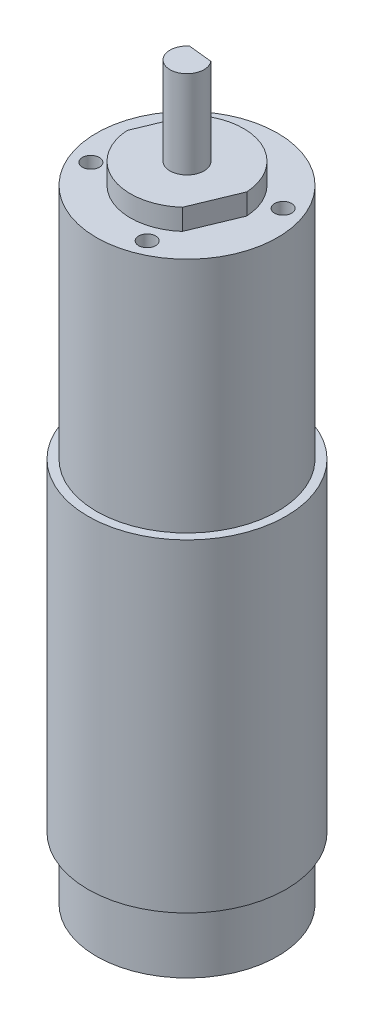
ISO-10303-21;
HEADER;
FILE_DESCRIPTION(('STEP AP214'),'2;1');
FILE_NAME('part.step','',(''),(''),'','','');
FILE_SCHEMA(('AUTOMOTIVE_DESIGN { 1 0 10303 214 1 1 1 1 }'));
ENDSEC;
DATA;
#1=APPLICATION_CONTEXT('core data for automotive mechanical design processes');
#2=APPLICATION_PROTOCOL_DEFINITION('international standard','automotive_design',2000,#1);
#3=PRODUCT_CONTEXT('',#1,'mechanical');
#4=PRODUCT('Part','Part','',(#3));
#5=PRODUCT_RELATED_PRODUCT_CATEGORY('part','',(#4));
#6=PRODUCT_DEFINITION_FORMATION('','',#4);
#7=PRODUCT_DEFINITION_CONTEXT('part definition',#1,'design');
#8=PRODUCT_DEFINITION('design','',#6,#7);
#9=PRODUCT_DEFINITION_SHAPE('','',#8);
#10=(LENGTH_UNIT() NAMED_UNIT(*) SI_UNIT(.MILLI.,.METRE.));
#11=(NAMED_UNIT(*) PLANE_ANGLE_UNIT() SI_UNIT($,.RADIAN.));
#12=(NAMED_UNIT(*) SI_UNIT($,.STERADIAN.) SOLID_ANGLE_UNIT());
#13=UNCERTAINTY_MEASURE_WITH_UNIT(LENGTH_MEASURE(1.E-05),#10,'distance_accuracy_value','');
#14=(GEOMETRIC_REPRESENTATION_CONTEXT(3) GLOBAL_UNCERTAINTY_ASSIGNED_CONTEXT((#13)) GLOBAL_UNIT_ASSIGNED_CONTEXT((#10,
#11,#12)) REPRESENTATION_CONTEXT('',''));
#15=CARTESIAN_POINT('',(0.,0.,0.));
#16=DIRECTION('',(0.,0.,1.));
#17=DIRECTION('',(1.,0.,0.));
#18=AXIS2_PLACEMENT_3D('',#15,#16,#17);
#19=CARTESIAN_POINT('',(0.,99.,0.));
#20=DIRECTION('',(0.,1.,0.));
#21=DIRECTION('',(0.,0.,1.));
#22=AXIS2_PLACEMENT_3D('',#19,#20,#21);
#23=PLANE('',#22);
#24=CARTESIAN_POINT('',(-4.97031789838213,99.,-12.0123245039843));
#25=DIRECTION('',(0.,1.,0.));
#26=DIRECTION('',(0.,0.,1.));
#27=AXIS2_PLACEMENT_3D('',#24,#25,#26);
#28=CIRCLE('',#27,1.5);
#29=CARTESIAN_POINT('',(-4.97031789838213,99.,-10.5123245039843));
#30=VERTEX_POINT('',#29);
#31=EDGE_CURVE('E145',#30,#30,#28,.T.);
#32=ORIENTED_EDGE('',*,*,#31,.F.);
#33=EDGE_LOOP('',(#32));
#34=FACE_BOUND('',#33,.T.);
#35=CARTESIAN_POINT('',(-12.0123245039843,99.,4.97031789838218));
#36=DIRECTION('',(0.,1.,0.));
#37=DIRECTION('',(0.,0.,1.));
#38=AXIS2_PLACEMENT_3D('',#35,#36,#37);
#39=CIRCLE('',#38,1.5);
#40=CARTESIAN_POINT('',(-12.0123245039843,99.,6.47031789838218));
#41=VERTEX_POINT('',#40);
#42=EDGE_CURVE('E151',#41,#41,#39,.T.);
#43=ORIENTED_EDGE('',*,*,#42,.F.);
#44=EDGE_LOOP('',(#43));
#45=FACE_BOUND('',#44,.T.);
#46=CARTESIAN_POINT('',(4.97031789838222,99.,12.0123245039843));
#47=DIRECTION('',(0.,1.,0.));
#48=DIRECTION('',(0.,0.,1.));
#49=AXIS2_PLACEMENT_3D('',#46,#47,#48);
#50=CIRCLE('',#49,1.5);
#51=CARTESIAN_POINT('',(4.97031789838222,99.,13.5123245039843));
#52=VERTEX_POINT('',#51);
#53=EDGE_CURVE('E140',#52,#52,#50,.T.);
#54=ORIENTED_EDGE('',*,*,#53,.F.);
#55=EDGE_LOOP('',(#54));
#56=FACE_BOUND('',#55,.T.);
#57=CARTESIAN_POINT('',(12.0123245039843,99.,-4.97031789838209));
#58=DIRECTION('',(0.,1.,0.));
#59=DIRECTION('',(0.,0.,1.));
#60=AXIS2_PLACEMENT_3D('',#57,#58,#59);
#61=CIRCLE('',#60,1.5);
#62=CARTESIAN_POINT('',(12.0123245039843,99.,-3.47031789838209));
#63=VERTEX_POINT('',#62);
#64=EDGE_CURVE('E144',#63,#63,#61,.T.);
#65=ORIENTED_EDGE('',*,*,#64,.F.);
#66=EDGE_LOOP('',(#65));
#67=FACE_BOUND('',#66,.T.);
#68=CARTESIAN_POINT('',(0.,99.,0.));
#69=DIRECTION('',(0.,1.,0.));
#70=DIRECTION('',(0.,0.,1.));
#71=AXIS2_PLACEMENT_3D('',#68,#69,#70);
#72=CIRCLE('',#71,16.);
#73=CARTESIAN_POINT('',(0.,99.,16.));
#74=VERTEX_POINT('',#73);
#75=EDGE_CURVE('E165',#74,#74,#72,.T.);
#76=ORIENTED_EDGE('',*,*,#75,.T.);
#77=EDGE_LOOP('',(#76));
#78=FACE_BOUND('',#77,.T.);
#79=DIRECTION('',(0.383034663383211,0.,-0.923733969629195));
#80=VECTOR('',#79,1.);
#81=CARTESIAN_POINT('',(6.64399633710222,99.,7.47377499477823));
#82=LINE('',#81,#80);
#83=CARTESIAN_POINT('',(6.64399633710222,99.,7.47377499477823));
#84=VERTEX_POINT('',#83);
#85=CARTESIAN_POINT('',(9.98321511622329,99.,-0.579151053880431));
#86=VERTEX_POINT('',#85);
#87=EDGE_CURVE('E127',#84,#86,#82,.T.);
#88=ORIENTED_EDGE('',*,*,#87,.F.);
#89=CARTESIAN_POINT('',(0.,99.,0.));
#90=DIRECTION('',(0.,1.,0.));
#91=DIRECTION('',(0.,0.,1.));
#92=AXIS2_PLACEMENT_3D('',#89,#90,#91);
#93=CIRCLE('',#92,10.);
#94=CARTESIAN_POINT('',(-9.98321511622329,99.,0.57915105388043));
#95=VERTEX_POINT('',#94);
#96=EDGE_CURVE('E111',#95,#84,#93,.T.);
#97=ORIENTED_EDGE('',*,*,#96,.F.);
#98=DIRECTION('',(-0.383034663383211,0.,0.923733969629195));
#99=VECTOR('',#98,1.);
#100=CARTESIAN_POINT('',(-9.98321511622329,99.,0.57915105388043));
#101=LINE('',#100,#99);
#102=CARTESIAN_POINT('',(-6.64399633710221,99.,-7.47377499477823));
#103=VERTEX_POINT('',#102);
#104=EDGE_CURVE('E118',#103,#95,#101,.T.);
#105=ORIENTED_EDGE('',*,*,#104,.F.);
#106=CARTESIAN_POINT('',(0.,99.,0.));
#107=DIRECTION('',(0.,1.,0.));
#108=DIRECTION('',(0.,0.,1.));
#109=AXIS2_PLACEMENT_3D('',#106,#107,#108);
#110=CIRCLE('',#109,10.);
#111=EDGE_CURVE('E129',#86,#103,#110,.T.);
#112=ORIENTED_EDGE('',*,*,#111,.F.);
#113=EDGE_LOOP('',(#88,#97,#105,#112));
#114=FACE_BOUND('',#113,.T.);
#115=ADVANCED_FACE('F35',(#34,#45,#56,#67,#78,#114),#23,.T.);
#116=CARTESIAN_POINT('',(0.,57.1,0.));
#117=DIRECTION('',(0.,-1.,0.));
#118=DIRECTION('',(0.,0.,-1.));
#119=AXIS2_PLACEMENT_3D('',#116,#117,#118);
#120=CYLINDRICAL_SURFACE('',#119,17.5);
#121=CARTESIAN_POINT('',(0.,57.1,0.));
#122=DIRECTION('',(0.,1.,0.));
#123=DIRECTION('',(0.,0.,1.));
#124=AXIS2_PLACEMENT_3D('',#121,#122,#123);
#125=CIRCLE('',#124,17.5);
#126=CARTESIAN_POINT('',(0.,57.1,17.5));
#127=VERTEX_POINT('',#126);
#128=EDGE_CURVE('E43',#127,#127,#125,.T.);
#129=ORIENTED_EDGE('',*,*,#128,.F.);
#130=EDGE_LOOP('',(#129));
#131=FACE_BOUND('',#130,.T.);
#132=CARTESIAN_POINT('',(0.,0.,0.));
#133=DIRECTION('',(0.,1.,0.));
#134=DIRECTION('',(0.,0.,1.));
#135=AXIS2_PLACEMENT_3D('',#132,#133,#134);
#136=CIRCLE('',#135,17.5);
#137=CARTESIAN_POINT('',(0.,0.,17.5));
#138=VERTEX_POINT('',#137);
#139=EDGE_CURVE('E173',#138,#138,#136,.T.);
#140=ORIENTED_EDGE('',*,*,#139,.T.);
#141=EDGE_LOOP('',(#140));
#142=FACE_BOUND('',#141,.T.);
#143=ADVANCED_FACE('F37',(#131,#142),#120,.T.);
#144=CARTESIAN_POINT('',(0.,57.1,0.));
#145=DIRECTION('',(0.,1.,0.));
#146=DIRECTION('',(0.,0.,1.));
#147=AXIS2_PLACEMENT_3D('',#144,#145,#146);
#148=PLANE('',#147);
#149=CARTESIAN_POINT('',(0.,57.1,0.));
#150=DIRECTION('',(0.,1.,0.));
#151=DIRECTION('',(0.,0.,1.));
#152=AXIS2_PLACEMENT_3D('',#149,#150,#151);
#153=CIRCLE('',#152,16.);
#154=CARTESIAN_POINT('',(0.,57.1,16.));
#155=VERTEX_POINT('',#154);
#156=EDGE_CURVE('E162',#155,#155,#153,.T.);
#157=ORIENTED_EDGE('',*,*,#156,.F.);
#158=EDGE_LOOP('',(#157));
#159=FACE_BOUND('',#158,.T.);
#160=ORIENTED_EDGE('',*,*,#128,.T.);
#161=EDGE_LOOP('',(#160));
#162=FACE_BOUND('',#161,.T.);
#163=ADVANCED_FACE('F182',(#159,#162),#148,.T.);
#164=CARTESIAN_POINT('',(0.,0.,0.));
#165=DIRECTION('',(0.,1.,0.));
#166=DIRECTION('',(0.,0.,1.));
#167=AXIS2_PLACEMENT_3D('',#164,#165,#166);
#168=PLANE('',#167);
#169=CARTESIAN_POINT('',(0.,0.,0.));
#170=DIRECTION('',(0.,1.,0.));
#171=DIRECTION('',(0.,0.,1.));
#172=AXIS2_PLACEMENT_3D('',#169,#170,#171);
#173=CIRCLE('',#172,16.);
#174=CARTESIAN_POINT('',(0.,0.,16.));
#175=VERTEX_POINT('',#174);
#176=EDGE_CURVE('E11',#175,#175,#173,.F.);
#177=ORIENTED_EDGE('',*,*,#176,.F.);
#178=EDGE_LOOP('',(#177));
#179=FACE_BOUND('',#178,.T.);
#180=ORIENTED_EDGE('',*,*,#139,.F.);
#181=EDGE_LOOP('',(#180));
#182=FACE_BOUND('',#181,.T.);
#183=ADVANCED_FACE('F179',(#179,#182),#168,.F.);
#184=CARTESIAN_POINT('',(0.,-11.,0.));
#185=DIRECTION('',(0.,1.,0.));
#186=DIRECTION('',(0.,0.,1.));
#187=AXIS2_PLACEMENT_3D('',#184,#185,#186);
#188=CYLINDRICAL_SURFACE('',#187,16.);
#189=CARTESIAN_POINT('',(0.,-11.,0.));
#190=DIRECTION('',(0.,-1.,0.));
#191=DIRECTION('',(0.,0.,-1.));
#192=AXIS2_PLACEMENT_3D('',#189,#190,#191);
#193=CIRCLE('',#192,16.);
#194=CARTESIAN_POINT('',(0.,-11.,-16.));
#195=VERTEX_POINT('',#194);
#196=EDGE_CURVE('E168',#195,#195,#193,.T.);
#197=ORIENTED_EDGE('',*,*,#196,.F.);
#198=EDGE_LOOP('',(#197));
#199=FACE_BOUND('',#198,.T.);
#200=ORIENTED_EDGE('',*,*,#176,.T.);
#201=EDGE_LOOP('',(#200));
#202=FACE_BOUND('',#201,.T.);
#203=ADVANCED_FACE('F181',(#199,#202),#188,.T.);
#204=CARTESIAN_POINT('',(0.,-11.,0.));
#205=DIRECTION('',(0.,-1.,0.));
#206=DIRECTION('',(0.,0.,-1.));
#207=AXIS2_PLACEMENT_3D('',#204,#205,#206);
#208=PLANE('',#207);
#209=ORIENTED_EDGE('',*,*,#196,.T.);
#210=EDGE_LOOP('',(#209));
#211=FACE_BOUND('',#210,.T.);
#212=ADVANCED_FACE('F188',(#211),#208,.T.);
#213=CARTESIAN_POINT('',(0.,99.,0.));
#214=DIRECTION('',(0.,-1.,0.));
#215=DIRECTION('',(0.,0.,-1.));
#216=AXIS2_PLACEMENT_3D('',#213,#214,#215);
#217=CYLINDRICAL_SURFACE('',#216,16.);
#218=ORIENTED_EDGE('',*,*,#75,.F.);
#219=EDGE_LOOP('',(#218));
#220=FACE_BOUND('',#219,.T.);
#221=ORIENTED_EDGE('',*,*,#156,.T.);
#222=EDGE_LOOP('',(#221));
#223=FACE_BOUND('',#222,.T.);
#224=ADVANCED_FACE('F207',(#220,#223),#217,.T.);
#225=CARTESIAN_POINT('',(12.0123245039843,84.,-4.97031789838209));
#226=DIRECTION('',(0.,1.,0.));
#227=DIRECTION('',(0.,0.,1.));
#228=AXIS2_PLACEMENT_3D('',#225,#226,#227);
#229=CYLINDRICAL_SURFACE('',#228,1.5);
#230=CARTESIAN_POINT('',(12.0123245039843,84.,-4.97031789838209));
#231=DIRECTION('',(0.,1.,0.));
#232=DIRECTION('',(0.,0.,1.));
#233=AXIS2_PLACEMENT_3D('',#230,#231,#232);
#234=CIRCLE('',#233,1.5);
#235=CARTESIAN_POINT('',(12.0123245039843,84.,-3.47031789838209));
#236=VERTEX_POINT('',#235);
#237=EDGE_CURVE('E159',#236,#236,#234,.T.);
#238=ORIENTED_EDGE('',*,*,#237,.F.);
#239=EDGE_LOOP('',(#238));
#240=FACE_BOUND('',#239,.T.);
#241=ORIENTED_EDGE('',*,*,#64,.T.);
#242=EDGE_LOOP('',(#241));
#243=FACE_BOUND('',#242,.T.);
#244=ADVANCED_FACE('F205',(#240,#243),#229,.F.);
#245=CARTESIAN_POINT('',(0.,84.,0.));
#246=DIRECTION('',(0.,1.,0.));
#247=DIRECTION('',(0.,0.,1.));
#248=AXIS2_PLACEMENT_3D('',#245,#246,#247);
#249=PLANE('',#248);
#250=ORIENTED_EDGE('',*,*,#237,.T.);
#251=EDGE_LOOP('',(#250));
#252=FACE_BOUND('',#251,.T.);
#253=ADVANCED_FACE('F230',(#252),#249,.T.);
#254=CARTESIAN_POINT('',(4.97031789838222,84.,12.0123245039843));
#255=DIRECTION('',(0.,1.,0.));
#256=DIRECTION('',(0.,0.,1.));
#257=AXIS2_PLACEMENT_3D('',#254,#255,#256);
#258=CYLINDRICAL_SURFACE('',#257,1.5);
#259=CARTESIAN_POINT('',(4.97031789838222,84.,12.0123245039843));
#260=DIRECTION('',(0.,1.,0.));
#261=DIRECTION('',(0.,0.,1.));
#262=AXIS2_PLACEMENT_3D('',#259,#260,#261);
#263=CIRCLE('',#262,1.5);
#264=CARTESIAN_POINT('',(4.97031789838222,84.,13.5123245039843));
#265=VERTEX_POINT('',#264);
#266=EDGE_CURVE('E154',#265,#265,#263,.T.);
#267=ORIENTED_EDGE('',*,*,#266,.F.);
#268=EDGE_LOOP('',(#267));
#269=FACE_BOUND('',#268,.T.);
#270=ORIENTED_EDGE('',*,*,#53,.T.);
#271=EDGE_LOOP('',(#270));
#272=FACE_BOUND('',#271,.T.);
#273=ADVANCED_FACE('F237',(#269,#272),#258,.F.);
#274=CARTESIAN_POINT('',(0.,84.,0.));
#275=DIRECTION('',(0.,1.,0.));
#276=DIRECTION('',(0.,0.,1.));
#277=AXIS2_PLACEMENT_3D('',#274,#275,#276);
#278=PLANE('',#277);
#279=ORIENTED_EDGE('',*,*,#266,.T.);
#280=EDGE_LOOP('',(#279));
#281=FACE_BOUND('',#280,.T.);
#282=ADVANCED_FACE('F244',(#281),#278,.T.);
#283=CARTESIAN_POINT('',(-12.0123245039843,84.,4.97031789838218));
#284=DIRECTION('',(0.,1.,0.));
#285=DIRECTION('',(0.,0.,1.));
#286=AXIS2_PLACEMENT_3D('',#283,#284,#285);
#287=CYLINDRICAL_SURFACE('',#286,1.5);
#288=CARTESIAN_POINT('',(-12.0123245039843,84.,4.97031789838218));
#289=DIRECTION('',(0.,1.,0.));
#290=DIRECTION('',(0.,0.,1.));
#291=AXIS2_PLACEMENT_3D('',#288,#289,#290);
#292=CIRCLE('',#291,1.5);
#293=CARTESIAN_POINT('',(-12.0123245039843,84.,6.47031789838218));
#294=VERTEX_POINT('',#293);
#295=EDGE_CURVE('E148',#294,#294,#292,.T.);
#296=ORIENTED_EDGE('',*,*,#295,.F.);
#297=EDGE_LOOP('',(#296));
#298=FACE_BOUND('',#297,.T.);
#299=ORIENTED_EDGE('',*,*,#42,.T.);
#300=EDGE_LOOP('',(#299));
#301=FACE_BOUND('',#300,.T.);
#302=ADVANCED_FACE('F252',(#298,#301),#287,.F.);
#303=CARTESIAN_POINT('',(0.,84.,0.));
#304=DIRECTION('',(0.,1.,0.));
#305=DIRECTION('',(0.,0.,1.));
#306=AXIS2_PLACEMENT_3D('',#303,#304,#305);
#307=PLANE('',#306);
#308=ORIENTED_EDGE('',*,*,#295,.T.);
#309=EDGE_LOOP('',(#308));
#310=FACE_BOUND('',#309,.T.);
#311=ADVANCED_FACE('F260',(#310),#307,.T.);
#312=CARTESIAN_POINT('',(-4.97031789838213,84.,-12.0123245039843));
#313=DIRECTION('',(0.,1.,0.));
#314=DIRECTION('',(0.,0.,1.));
#315=AXIS2_PLACEMENT_3D('',#312,#313,#314);
#316=CYLINDRICAL_SURFACE('',#315,1.5);
#317=CARTESIAN_POINT('',(-4.97031789838213,84.,-12.0123245039843));
#318=DIRECTION('',(0.,1.,0.));
#319=DIRECTION('',(0.,0.,1.));
#320=AXIS2_PLACEMENT_3D('',#317,#318,#319);
#321=CIRCLE('',#320,1.5);
#322=CARTESIAN_POINT('',(-4.97031789838213,84.,-10.5123245039843));
#323=VERTEX_POINT('',#322);
#324=EDGE_CURVE('E141',#323,#323,#321,.T.);
#325=ORIENTED_EDGE('',*,*,#324,.F.);
#326=EDGE_LOOP('',(#325));
#327=FACE_BOUND('',#326,.T.);
#328=ORIENTED_EDGE('',*,*,#31,.T.);
#329=EDGE_LOOP('',(#328));
#330=FACE_BOUND('',#329,.T.);
#331=ADVANCED_FACE('F268',(#327,#330),#316,.F.);
#332=CARTESIAN_POINT('',(0.,84.,0.));
#333=DIRECTION('',(0.,1.,0.));
#334=DIRECTION('',(0.,0.,1.));
#335=AXIS2_PLACEMENT_3D('',#332,#333,#334);
#336=PLANE('',#335);
#337=ORIENTED_EDGE('',*,*,#324,.T.);
#338=EDGE_LOOP('',(#337));
#339=FACE_BOUND('',#338,.T.);
#340=ADVANCED_FACE('F276',(#339),#336,.T.);
#341=CARTESIAN_POINT('',(0.,102.7,0.));
#342=DIRECTION('',(0.,-1.,0.));
#343=DIRECTION('',(0.,0.,-1.));
#344=AXIS2_PLACEMENT_3D('',#341,#342,#343);
#345=CYLINDRICAL_SURFACE('',#344,10.);
#346=ORIENTED_EDGE('',*,*,#96,.T.);
#347=DIRECTION('',(0.,-1.,0.));
#348=VECTOR('',#347,1.);
#349=CARTESIAN_POINT('',(6.64399633710222,102.7,7.47377499477823));
#350=LINE('',#349,#348);
#351=CARTESIAN_POINT('',(6.64399633710222,102.7,7.47377499477823));
#352=VERTEX_POINT('',#351);
#353=EDGE_CURVE('E138',#352,#84,#350,.T.);
#354=ORIENTED_EDGE('',*,*,#353,.F.);
#355=CARTESIAN_POINT('',(0.,102.7,0.));
#356=DIRECTION('',(0.,1.,0.));
#357=DIRECTION('',(0.,0.,1.));
#358=AXIS2_PLACEMENT_3D('',#355,#356,#357);
#359=CIRCLE('',#358,10.);
#360=CARTESIAN_POINT('',(-9.98321511622329,102.7,0.57915105388043));
#361=VERTEX_POINT('',#360);
#362=EDGE_CURVE('E114',#361,#352,#359,.T.);
#363=ORIENTED_EDGE('',*,*,#362,.F.);
#364=DIRECTION('',(0.,-1.,0.));
#365=VECTOR('',#364,1.);
#366=CARTESIAN_POINT('',(-9.98321511622329,102.7,0.57915105388043));
#367=LINE('',#366,#365);
#368=EDGE_CURVE('E124',#361,#95,#367,.T.);
#369=ORIENTED_EDGE('',*,*,#368,.T.);
#370=EDGE_LOOP('',(#346,#354,#363,#369));
#371=FACE_BOUND('',#370,.T.);
#372=ADVANCED_FACE('F284',(#371),#345,.T.);
#373=CARTESIAN_POINT('',(6.64399633710222,102.7,7.47377499477823));
#374=DIRECTION('',(-0.923733969629195,0.,-0.383034663383211));
#375=DIRECTION('',(-0.383034663383211,0.,0.923733969629195));
#376=AXIS2_PLACEMENT_3D('',#373,#374,#375);
#377=PLANE('',#376);
#378=ORIENTED_EDGE('',*,*,#87,.T.);
#379=DIRECTION('',(0.,-1.,0.));
#380=VECTOR('',#379,1.);
#381=CARTESIAN_POINT('',(9.98321511622329,102.7,-0.579151053880431));
#382=LINE('',#381,#380);
#383=CARTESIAN_POINT('',(9.98321511622329,102.7,-0.579151053880431));
#384=VERTEX_POINT('',#383);
#385=EDGE_CURVE('E135',#384,#86,#382,.T.);
#386=ORIENTED_EDGE('',*,*,#385,.F.);
#387=DIRECTION('',(0.383034663383211,0.,-0.923733969629195));
#388=VECTOR('',#387,1.);
#389=CARTESIAN_POINT('',(6.64399633710222,102.7,7.47377499477823));
#390=LINE('',#389,#388);
#391=EDGE_CURVE('E117',#352,#384,#390,.T.);
#392=ORIENTED_EDGE('',*,*,#391,.F.);
#393=ORIENTED_EDGE('',*,*,#353,.T.);
#394=EDGE_LOOP('',(#378,#386,#392,#393));
#395=FACE_BOUND('',#394,.T.);
#396=ADVANCED_FACE('F292',(#395),#377,.F.);
#397=CARTESIAN_POINT('',(0.,102.7,0.));
#398=DIRECTION('',(0.,-1.,0.));
#399=DIRECTION('',(0.,0.,-1.));
#400=AXIS2_PLACEMENT_3D('',#397,#398,#399);
#401=CYLINDRICAL_SURFACE('',#400,10.);
#402=ORIENTED_EDGE('',*,*,#111,.T.);
#403=DIRECTION('',(0.,-1.,0.));
#404=VECTOR('',#403,1.);
#405=CARTESIAN_POINT('',(-6.64399633710221,102.7,-7.47377499477823));
#406=LINE('',#405,#404);
#407=CARTESIAN_POINT('',(-6.64399633710221,102.7,-7.47377499477823));
#408=VERTEX_POINT('',#407);
#409=EDGE_CURVE('E58',#408,#103,#406,.T.);
#410=ORIENTED_EDGE('',*,*,#409,.F.);
#411=CARTESIAN_POINT('',(0.,102.7,0.));
#412=DIRECTION('',(0.,1.,0.));
#413=DIRECTION('',(0.,0.,1.));
#414=AXIS2_PLACEMENT_3D('',#411,#412,#413);
#415=CIRCLE('',#414,10.);
#416=EDGE_CURVE('E120',#384,#408,#415,.T.);
#417=ORIENTED_EDGE('',*,*,#416,.F.);
#418=ORIENTED_EDGE('',*,*,#385,.T.);
#419=EDGE_LOOP('',(#402,#410,#417,#418));
#420=FACE_BOUND('',#419,.T.);
#421=ADVANCED_FACE('F300',(#420),#401,.T.);
#422=CARTESIAN_POINT('',(-9.98321511622329,102.7,0.57915105388043));
#423=DIRECTION('',(0.923733969629195,0.,0.383034663383211));
#424=DIRECTION('',(0.383034663383211,0.,-0.923733969629195));
#425=AXIS2_PLACEMENT_3D('',#422,#423,#424);
#426=PLANE('',#425);
#427=ORIENTED_EDGE('',*,*,#104,.T.);
#428=ORIENTED_EDGE('',*,*,#368,.F.);
#429=DIRECTION('',(-0.383034663383211,0.,0.923733969629195));
#430=VECTOR('',#429,1.);
#431=CARTESIAN_POINT('',(-9.98321511622329,102.7,0.57915105388043));
#432=LINE('',#431,#430);
#433=EDGE_CURVE('E122',#408,#361,#432,.T.);
#434=ORIENTED_EDGE('',*,*,#433,.F.);
#435=ORIENTED_EDGE('',*,*,#409,.T.);
#436=EDGE_LOOP('',(#427,#428,#434,#435));
#437=FACE_BOUND('',#436,.T.);
#438=ADVANCED_FACE('F308',(#437),#426,.F.);
#439=CARTESIAN_POINT('',(0.,102.7,0.));
#440=DIRECTION('',(0.,1.,0.));
#441=DIRECTION('',(0.,0.,1.));
#442=AXIS2_PLACEMENT_3D('',#439,#440,#441);
#443=PLANE('',#442);
#444=CARTESIAN_POINT('',(0.,102.7,0.));
#445=DIRECTION('',(0.,1.,0.));
#446=DIRECTION('',(0.,0.,1.));
#447=AXIS2_PLACEMENT_3D('',#444,#445,#446);
#448=CIRCLE('',#447,3.);
#449=CARTESIAN_POINT('',(0.,102.7,3.));
#450=VERTEX_POINT('',#449);
#451=EDGE_CURVE('E106',#450,#450,#448,.T.);
#452=ORIENTED_EDGE('',*,*,#451,.F.);
#453=EDGE_LOOP('',(#452));
#454=FACE_BOUND('',#453,.T.);
#455=ORIENTED_EDGE('',*,*,#362,.T.);
#456=ORIENTED_EDGE('',*,*,#391,.T.);
#457=ORIENTED_EDGE('',*,*,#416,.T.);
#458=ORIENTED_EDGE('',*,*,#433,.T.);
#459=EDGE_LOOP('',(#455,#456,#457,#458));
#460=FACE_BOUND('',#459,.T.);
#461=ADVANCED_FACE('F316',(#454,#460),#443,.T.);
#462=CARTESIAN_POINT('',(0.,118.2,0.));
#463=DIRECTION('',(0.,-1.,0.));
#464=DIRECTION('',(0.,0.,-1.));
#465=AXIS2_PLACEMENT_3D('',#462,#463,#464);
#466=CYLINDRICAL_SURFACE('',#465,3.);
#467=CARTESIAN_POINT('',(0.,118.2,0.));
#468=DIRECTION('',(0.,1.,0.));
#469=DIRECTION('',(0.,0.,1.));
#470=AXIS2_PLACEMENT_3D('',#467,#468,#469);
#471=CIRCLE('',#470,3.);
#472=CARTESIAN_POINT('',(-1.88385120732796,118.2,-2.33476007946191));
#473=VERTEX_POINT('',#472);
#474=CARTESIAN_POINT('',(2.33476007946191,118.2,-1.88385120732796));
#475=VERTEX_POINT('',#474);
#476=EDGE_CURVE('E104',#473,#475,#471,.T.);
#477=ORIENTED_EDGE('',*,*,#476,.F.);
#478=DIRECTION('',(0.,1.,0.));
#479=VECTOR('',#478,1.);
#480=CARTESIAN_POINT('',(-1.88385120732796,108.2,-2.33476007946191));
#481=LINE('',#480,#479);
#482=CARTESIAN_POINT('',(-1.88385120732796,108.2,-2.33476007946191));
#483=VERTEX_POINT('',#482);
#484=EDGE_CURVE('E50',#483,#473,#481,.T.);
#485=ORIENTED_EDGE('',*,*,#484,.F.);
#486=CARTESIAN_POINT('',(0.,108.2,0.));
#487=DIRECTION('',(0.,1.,0.));
#488=DIRECTION('',(0.,0.,1.));
#489=AXIS2_PLACEMENT_3D('',#486,#487,#488);
#490=CIRCLE('',#489,3.);
#491=CARTESIAN_POINT('',(2.33476007946191,108.2,-1.88385120732796));
#492=VERTEX_POINT('',#491);
#493=EDGE_CURVE('E90',#492,#483,#490,.T.);
#494=ORIENTED_EDGE('',*,*,#493,.F.);
#495=DIRECTION('',(0.,1.,0.));
#496=VECTOR('',#495,1.);
#497=CARTESIAN_POINT('',(2.33476007946191,108.2,-1.88385120732796));
#498=LINE('',#497,#496);
#499=EDGE_CURVE('E98',#492,#475,#498,.T.);
#500=ORIENTED_EDGE('',*,*,#499,.T.);
#501=EDGE_LOOP('',(#477,#485,#494,#500));
#502=FACE_BOUND('',#501,.T.);
#503=ORIENTED_EDGE('',*,*,#451,.T.);
#504=EDGE_LOOP('',(#503));
#505=FACE_BOUND('',#504,.T.);
#506=ADVANCED_FACE('F101',(#502,#505),#466,.T.);
#507=CARTESIAN_POINT('',(0.,118.2,0.));
#508=DIRECTION('',(0.,1.,0.));
#509=DIRECTION('',(0.,0.,1.));
#510=AXIS2_PLACEMENT_3D('',#507,#508,#509);
#511=PLANE('',#510);
#512=DIRECTION('',(0.994336216026408,0.,0.106280240394365));
#513=VECTOR('',#512,1.);
#514=CARTESIAN_POINT('',(0.225454436066975,118.2,-2.10930564339494));
#515=LINE('',#514,#513);
#516=EDGE_CURVE('E95',#473,#475,#515,.T.);
#517=ORIENTED_EDGE('',*,*,#516,.F.);
#518=ORIENTED_EDGE('',*,*,#476,.T.);
#519=EDGE_LOOP('',(#517,#518));
#520=FACE_BOUND('',#519,.T.);
#521=ADVANCED_FACE('F330',(#520),#511,.T.);
#522=CARTESIAN_POINT('',(0.225454436066975,108.2,-2.10930564339494));
#523=DIRECTION('',(-0.106280240394365,0.,0.994336216026408));
#524=DIRECTION('',(0.994336216026408,0.,0.106280240394365));
#525=AXIS2_PLACEMENT_3D('',#522,#523,#524);
#526=PLANE('',#525);
#527=ORIENTED_EDGE('',*,*,#516,.T.);
#528=ORIENTED_EDGE('',*,*,#499,.F.);
#529=DIRECTION('',(0.994336216026408,0.,0.106280240394365));
#530=VECTOR('',#529,1.);
#531=CARTESIAN_POINT('',(0.225454436066975,108.2,-2.10930564339494));
#532=LINE('',#531,#530);
#533=EDGE_CURVE('E92',#483,#492,#532,.T.);
#534=ORIENTED_EDGE('',*,*,#533,.F.);
#535=ORIENTED_EDGE('',*,*,#484,.T.);
#536=EDGE_LOOP('',(#527,#528,#534,#535));
#537=FACE_BOUND('',#536,.T.);
#538=ADVANCED_FACE('F97',(#537),#526,.F.);
#539=CARTESIAN_POINT('',(0.,108.2,0.));
#540=DIRECTION('',(0.,1.,0.));
#541=DIRECTION('',(0.,0.,1.));
#542=AXIS2_PLACEMENT_3D('',#539,#540,#541);
#543=PLANE('',#542);
#544=ORIENTED_EDGE('',*,*,#493,.T.);
#545=ORIENTED_EDGE('',*,*,#533,.T.);
#546=EDGE_LOOP('',(#544,#545));
#547=FACE_BOUND('',#546,.T.);
#548=ADVANCED_FACE('F91',(#547),#543,.T.);
#549=CLOSED_SHELL('',(#115,#143,#163,#183,#203,#212,#224,#244,#253,#273,#282,#302,#311,#331,
#340,#372,#396,#421,#438,#461,#506,#521,#538,#548));
#550=MANIFOLD_SOLID_BREP('B2',#549);
#551=ADVANCED_BREP_SHAPE_REPRESENTATION('',(#18,#550),#14);
#552=SHAPE_DEFINITION_REPRESENTATION(#9,#551);
ENDSEC;
END-ISO-10303-21;
